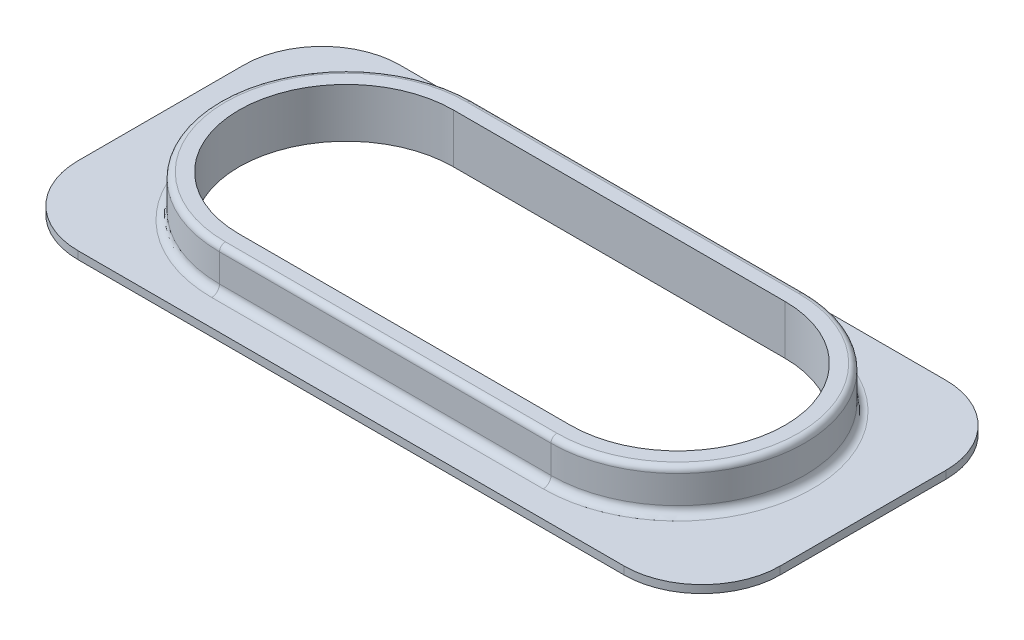
ISO-10303-21;
HEADER;
FILE_DESCRIPTION(('STEP AP214'),'2;1');
FILE_NAME('part.step','',(''),(''),'','','');
FILE_SCHEMA(('AUTOMOTIVE_DESIGN { 1 0 10303 214 1 1 1 1 }'));
ENDSEC;
DATA;
#1=APPLICATION_CONTEXT('core data for automotive mechanical design processes');
#2=APPLICATION_PROTOCOL_DEFINITION('international standard','automotive_design',2000,#1);
#3=PRODUCT_CONTEXT('',#1,'mechanical');
#4=PRODUCT('Part','Part','',(#3));
#5=PRODUCT_RELATED_PRODUCT_CATEGORY('part','',(#4));
#6=PRODUCT_DEFINITION_FORMATION('','',#4);
#7=PRODUCT_DEFINITION_CONTEXT('part definition',#1,'design');
#8=PRODUCT_DEFINITION('design','',#6,#7);
#9=PRODUCT_DEFINITION_SHAPE('','',#8);
#10=(LENGTH_UNIT() NAMED_UNIT(*) SI_UNIT(.MILLI.,.METRE.));
#11=(NAMED_UNIT(*) PLANE_ANGLE_UNIT() SI_UNIT($,.RADIAN.));
#12=(NAMED_UNIT(*) SI_UNIT($,.STERADIAN.) SOLID_ANGLE_UNIT());
#13=UNCERTAINTY_MEASURE_WITH_UNIT(LENGTH_MEASURE(1.E-05),#10,'distance_accuracy_value','');
#14=(GEOMETRIC_REPRESENTATION_CONTEXT(3) GLOBAL_UNCERTAINTY_ASSIGNED_CONTEXT((#13)) GLOBAL_UNIT_ASSIGNED_CONTEXT((#10,
#11,#12)) REPRESENTATION_CONTEXT('',''));
#15=CARTESIAN_POINT('',(0.,0.,0.));
#16=DIRECTION('',(0.,0.,1.));
#17=DIRECTION('',(1.,0.,0.));
#18=AXIS2_PLACEMENT_3D('',#15,#16,#17);
#19=CARTESIAN_POINT('',(-9.97047970479705,2.125,-1.47047970479705));
#20=DIRECTION('',(0.,1.,0.));
#21=DIRECTION('',(0.,0.,1.));
#22=AXIS2_PLACEMENT_3D('',#19,#20,#21);
#23=PLANE('',#22);
#24=DIRECTION('',(-1.,0.,0.));
#25=VECTOR('',#24,1.);
#26=CARTESIAN_POINT('',(-9.97047970479705,2.125,-7.67047970479705));
#27=LINE('',#26,#25);
#28=CARTESIAN_POINT('',(7.02952029520295,2.125,-7.67047970479705));
#29=VERTEX_POINT('',#28);
#30=CARTESIAN_POINT('',(-9.97047970479705,2.125,-7.67047970479705));
#31=VERTEX_POINT('',#30);
#32=EDGE_CURVE('E286',#29,#31,#27,.T.);
#33=ORIENTED_EDGE('',*,*,#32,.T.);
#34=CARTESIAN_POINT('',(-9.97047970479705,2.125,-1.47047970479705));
#35=DIRECTION('',(0.,1.,0.));
#36=DIRECTION('',(0.,0.,1.));
#37=AXIS2_PLACEMENT_3D('',#34,#35,#36);
#38=CIRCLE('',#37,6.2);
#39=CARTESIAN_POINT('',(-9.97047970479705,2.125,4.72952029520295));
#40=VERTEX_POINT('',#39);
#41=EDGE_CURVE('E288',#31,#40,#38,.T.);
#42=ORIENTED_EDGE('',*,*,#41,.T.);
#43=DIRECTION('',(1.,0.,0.));
#44=VECTOR('',#43,1.);
#45=CARTESIAN_POINT('',(7.02952029520295,2.125,4.72952029520295));
#46=LINE('',#45,#44);
#47=CARTESIAN_POINT('',(7.02952029520295,2.125,4.72952029520295));
#48=VERTEX_POINT('',#47);
#49=EDGE_CURVE('E282',#40,#48,#46,.T.);
#50=ORIENTED_EDGE('',*,*,#49,.T.);
#51=CARTESIAN_POINT('',(7.02952029520295,2.125,-1.47047970479705));
#52=DIRECTION('',(0.,1.,0.));
#53=DIRECTION('',(0.,0.,1.));
#54=AXIS2_PLACEMENT_3D('',#51,#52,#53);
#55=CIRCLE('',#54,6.2);
#56=EDGE_CURVE('E284',#48,#29,#55,.T.);
#57=ORIENTED_EDGE('',*,*,#56,.T.);
#58=EDGE_LOOP('',(#33,#42,#50,#57));
#59=FACE_BOUND('',#58,.T.);
#60=DIRECTION('',(1.,0.,0.));
#61=VECTOR('',#60,1.);
#62=CARTESIAN_POINT('',(-9.97047970479705,2.125,4.02952029520295));
#63=LINE('',#62,#61);
#64=CARTESIAN_POINT('',(-9.97047970479705,2.125,4.02952029520295));
#65=VERTEX_POINT('',#64);
#66=CARTESIAN_POINT('',(7.02952029520295,2.125,4.02952029520295));
#67=VERTEX_POINT('',#66);
#68=EDGE_CURVE('E225',#65,#67,#63,.T.);
#69=ORIENTED_EDGE('',*,*,#68,.F.);
#70=CARTESIAN_POINT('',(-9.97047970479705,2.125,-1.47047970479705));
#71=DIRECTION('',(0.,1.,0.));
#72=DIRECTION('',(0.,0.,1.));
#73=AXIS2_PLACEMENT_3D('',#70,#71,#72);
#74=CIRCLE('',#73,5.5);
#75=CARTESIAN_POINT('',(-9.97047970479705,2.125,-6.97047970479705));
#76=VERTEX_POINT('',#75);
#77=EDGE_CURVE('E210',#76,#65,#74,.T.);
#78=ORIENTED_EDGE('',*,*,#77,.F.);
#79=DIRECTION('',(-1.,0.,0.));
#80=VECTOR('',#79,1.);
#81=CARTESIAN_POINT('',(-9.97047970479705,2.125,-6.97047970479705));
#82=LINE('',#81,#80);
#83=CARTESIAN_POINT('',(7.02952029520295,2.125,-6.97047970479705));
#84=VERTEX_POINT('',#83);
#85=EDGE_CURVE('E182',#84,#76,#82,.T.);
#86=ORIENTED_EDGE('',*,*,#85,.F.);
#87=CARTESIAN_POINT('',(7.02952029520295,2.125,-1.47047970479705));
#88=DIRECTION('',(0.,1.,0.));
#89=DIRECTION('',(0.,0.,1.));
#90=AXIS2_PLACEMENT_3D('',#87,#88,#89);
#91=CIRCLE('',#90,5.5);
#92=EDGE_CURVE('E227',#67,#84,#91,.T.);
#93=ORIENTED_EDGE('',*,*,#92,.F.);
#94=EDGE_LOOP('',(#69,#78,#86,#93));
#95=FACE_BOUND('',#94,.T.);
#96=ADVANCED_FACE('F37',(#59,#95),#23,.T.);
#97=CARTESIAN_POINT('',(-9.97047970479705,2.125,-1.47047970479705));
#98=DIRECTION('',(0.,-1.,0.));
#99=DIRECTION('',(0.,0.,-1.));
#100=AXIS2_PLACEMENT_3D('',#97,#98,#99);
#101=CYLINDRICAL_SURFACE('',#100,6.5);
#102=DIRECTION('',(0.,-1.,0.));
#103=VECTOR('',#102,1.);
#104=CARTESIAN_POINT('',(-9.97047970479705,2.125,-7.97047970479705));
#105=LINE('',#104,#103);
#106=CARTESIAN_POINT('',(-9.97047970479705,1.825,-7.97047970479705));
#107=VERTEX_POINT('',#106);
#108=CARTESIAN_POINT('',(-9.97047970479705,0.4,-7.97047970479705));
#109=VERTEX_POINT('',#108);
#110=EDGE_CURVE('E235',#107,#109,#105,.T.);
#111=ORIENTED_EDGE('',*,*,#110,.T.);
#112=CARTESIAN_POINT('',(-9.97047970479705,0.4,-1.47047970479705));
#113=DIRECTION('',(0.,-1.,0.));
#114=DIRECTION('',(0.,0.,-1.));
#115=AXIS2_PLACEMENT_3D('',#112,#113,#114);
#116=CIRCLE('',#115,6.5);
#117=CARTESIAN_POINT('',(-9.97047970479705,0.4,5.02952029520295));
#118=VERTEX_POINT('',#117);
#119=EDGE_CURVE('E300',#109,#118,#116,.F.);
#120=ORIENTED_EDGE('',*,*,#119,.T.);
#121=DIRECTION('',(0.,-1.,0.));
#122=VECTOR('',#121,1.);
#123=CARTESIAN_POINT('',(-9.97047970479705,2.125,5.02952029520295));
#124=LINE('',#123,#122);
#125=CARTESIAN_POINT('',(-9.97047970479705,1.825,5.02952029520295));
#126=VERTEX_POINT('',#125);
#127=EDGE_CURVE('E242',#126,#118,#124,.T.);
#128=ORIENTED_EDGE('',*,*,#127,.F.);
#129=CARTESIAN_POINT('',(-9.97047970479705,1.825,-1.47047970479705));
#130=DIRECTION('',(0.,1.,0.));
#131=DIRECTION('',(0.,0.,1.));
#132=AXIS2_PLACEMENT_3D('',#129,#130,#131);
#133=CIRCLE('',#132,6.5);
#134=EDGE_CURVE('E291',#126,#107,#133,.F.);
#135=ORIENTED_EDGE('',*,*,#134,.T.);
#136=EDGE_LOOP('',(#111,#120,#128,#135));
#137=FACE_BOUND('',#136,.T.);
#138=ADVANCED_FACE('F352',(#137),#101,.T.);
#139=CARTESIAN_POINT('',(-9.97047970479705,2.125,5.02952029520295));
#140=DIRECTION('',(0.,0.,-1.));
#141=DIRECTION('',(-1.,0.,0.));
#142=AXIS2_PLACEMENT_3D('',#139,#140,#141);
#143=PLANE('',#142);
#144=ORIENTED_EDGE('',*,*,#127,.T.);
#145=DIRECTION('',(1.,0.,0.));
#146=VECTOR('',#145,1.);
#147=CARTESIAN_POINT('',(7.02952029520295,0.4,5.02952029520295));
#148=LINE('',#147,#146);
#149=CARTESIAN_POINT('',(7.02952029520295,0.4,5.02952029520295));
#150=VERTEX_POINT('',#149);
#151=EDGE_CURVE('E11',#118,#150,#148,.T.);
#152=ORIENTED_EDGE('',*,*,#151,.T.);
#153=DIRECTION('',(0.,-1.,0.));
#154=VECTOR('',#153,1.);
#155=CARTESIAN_POINT('',(7.02952029520295,2.125,5.02952029520295));
#156=LINE('',#155,#154);
#157=CARTESIAN_POINT('',(7.02952029520295,1.825,5.02952029520295));
#158=VERTEX_POINT('',#157);
#159=EDGE_CURVE('E240',#158,#150,#156,.T.);
#160=ORIENTED_EDGE('',*,*,#159,.F.);
#161=DIRECTION('',(1.,0.,0.));
#162=VECTOR('',#161,1.);
#163=CARTESIAN_POINT('',(-9.97047970479705,1.825,5.02952029520295));
#164=LINE('',#163,#162);
#165=EDGE_CURVE('E298',#158,#126,#164,.F.);
#166=ORIENTED_EDGE('',*,*,#165,.T.);
#167=EDGE_LOOP('',(#144,#152,#160,#166));
#168=FACE_BOUND('',#167,.T.);
#169=ADVANCED_FACE('F355',(#168),#143,.F.);
#170=CARTESIAN_POINT('',(7.02952029520295,2.125,-1.47047970479705));
#171=DIRECTION('',(0.,-1.,0.));
#172=DIRECTION('',(0.,0.,-1.));
#173=AXIS2_PLACEMENT_3D('',#170,#171,#172);
#174=CYLINDRICAL_SURFACE('',#173,6.5);
#175=ORIENTED_EDGE('',*,*,#159,.T.);
#176=CARTESIAN_POINT('',(7.02952029520295,0.4,-1.47047970479705));
#177=DIRECTION('',(0.,-1.,0.));
#178=DIRECTION('',(0.,0.,-1.));
#179=AXIS2_PLACEMENT_3D('',#176,#177,#178);
#180=CIRCLE('',#179,6.5);
#181=CARTESIAN_POINT('',(7.02952029520295,0.4,-7.97047970479705));
#182=VERTEX_POINT('',#181);
#183=EDGE_CURVE('E46',#150,#182,#180,.F.);
#184=ORIENTED_EDGE('',*,*,#183,.T.);
#185=DIRECTION('',(0.,-1.,0.));
#186=VECTOR('',#185,1.);
#187=CARTESIAN_POINT('',(7.02952029520295,2.125,-7.97047970479705));
#188=LINE('',#187,#186);
#189=CARTESIAN_POINT('',(7.02952029520295,1.825,-7.97047970479705));
#190=VERTEX_POINT('',#189);
#191=EDGE_CURVE('E238',#190,#182,#188,.T.);
#192=ORIENTED_EDGE('',*,*,#191,.F.);
#193=CARTESIAN_POINT('',(7.02952029520295,1.825,-1.47047970479705));
#194=DIRECTION('',(0.,1.,0.));
#195=DIRECTION('',(0.,0.,1.));
#196=AXIS2_PLACEMENT_3D('',#193,#194,#195);
#197=CIRCLE('',#196,6.5);
#198=EDGE_CURVE('E296',#190,#158,#197,.F.);
#199=ORIENTED_EDGE('',*,*,#198,.T.);
#200=EDGE_LOOP('',(#175,#184,#192,#199));
#201=FACE_BOUND('',#200,.T.);
#202=ADVANCED_FACE('F370',(#201),#174,.T.);
#203=CARTESIAN_POINT('',(-9.97047970479705,2.125,-7.97047970479705));
#204=DIRECTION('',(0.,0.,1.));
#205=DIRECTION('',(1.,0.,0.));
#206=AXIS2_PLACEMENT_3D('',#203,#204,#205);
#207=PLANE('',#206);
#208=ORIENTED_EDGE('',*,*,#191,.T.);
#209=DIRECTION('',(-1.,0.,0.));
#210=VECTOR('',#209,1.);
#211=CARTESIAN_POINT('',(-9.97047970479705,0.4,-7.97047970479705));
#212=LINE('',#211,#210);
#213=EDGE_CURVE('E321',#182,#109,#212,.T.);
#214=ORIENTED_EDGE('',*,*,#213,.T.);
#215=ORIENTED_EDGE('',*,*,#110,.F.);
#216=DIRECTION('',(-1.,0.,0.));
#217=VECTOR('',#216,1.);
#218=CARTESIAN_POINT('',(7.02952029520295,1.825,-7.97047970479705));
#219=LINE('',#218,#217);
#220=EDGE_CURVE('E294',#107,#190,#219,.F.);
#221=ORIENTED_EDGE('',*,*,#220,.T.);
#222=EDGE_LOOP('',(#208,#214,#215,#221));
#223=FACE_BOUND('',#222,.T.);
#224=ADVANCED_FACE('F368',(#223),#207,.F.);
#225=CARTESIAN_POINT('',(-9.97047970479705,2.125,-1.47047970479705));
#226=DIRECTION('',(0.,-1.,0.));
#227=DIRECTION('',(0.,0.,-1.));
#228=AXIS2_PLACEMENT_3D('',#225,#226,#227);
#229=CYLINDRICAL_SURFACE('',#228,5.5);
#230=DIRECTION('',(0.,-1.,0.));
#231=VECTOR('',#230,1.);
#232=CARTESIAN_POINT('',(-9.97047970479705,2.125,4.02952029520295));
#233=LINE('',#232,#231);
#234=CARTESIAN_POINT('',(-9.97047970479705,-0.4,4.02952029520295));
#235=VERTEX_POINT('',#234);
#236=EDGE_CURVE('E191',#65,#235,#233,.T.);
#237=ORIENTED_EDGE('',*,*,#236,.T.);
#238=CARTESIAN_POINT('',(-9.97047970479705,-0.4,-1.47047970479705));
#239=DIRECTION('',(0.,-1.,0.));
#240=DIRECTION('',(0.,0.,-1.));
#241=AXIS2_PLACEMENT_3D('',#238,#239,#240);
#242=CIRCLE('',#241,5.5);
#243=CARTESIAN_POINT('',(-9.97047970479705,-0.4,-6.97047970479705));
#244=VERTEX_POINT('',#243);
#245=EDGE_CURVE('E188',#244,#235,#242,.F.);
#246=ORIENTED_EDGE('',*,*,#245,.F.);
#247=DIRECTION('',(0.,-1.,0.));
#248=VECTOR('',#247,1.);
#249=CARTESIAN_POINT('',(-9.97047970479705,2.125,-6.97047970479705));
#250=LINE('',#249,#248);
#251=EDGE_CURVE('E176',#76,#244,#250,.T.);
#252=ORIENTED_EDGE('',*,*,#251,.F.);
#253=ORIENTED_EDGE('',*,*,#77,.T.);
#254=EDGE_LOOP('',(#237,#246,#252,#253));
#255=FACE_BOUND('',#254,.T.);
#256=ADVANCED_FACE('F189',(#255),#229,.F.);
#257=CARTESIAN_POINT('',(-9.97047970479705,2.125,4.02952029520295));
#258=DIRECTION('',(0.,0.,-1.));
#259=DIRECTION('',(-1.,0.,0.));
#260=AXIS2_PLACEMENT_3D('',#257,#258,#259);
#261=PLANE('',#260);
#262=DIRECTION('',(0.,-1.,0.));
#263=VECTOR('',#262,1.);
#264=CARTESIAN_POINT('',(7.02952029520295,2.125,4.02952029520295));
#265=LINE('',#264,#263);
#266=CARTESIAN_POINT('',(7.02952029520295,-0.4,4.02952029520295));
#267=VERTEX_POINT('',#266);
#268=EDGE_CURVE('E232',#67,#267,#265,.T.);
#269=ORIENTED_EDGE('',*,*,#268,.T.);
#270=DIRECTION('',(1.,0.,0.));
#271=VECTOR('',#270,1.);
#272=CARTESIAN_POINT('',(0.,-0.4,4.02952029520295));
#273=LINE('',#272,#271);
#274=EDGE_CURVE('E195',#235,#267,#273,.T.);
#275=ORIENTED_EDGE('',*,*,#274,.F.);
#276=ORIENTED_EDGE('',*,*,#236,.F.);
#277=ORIENTED_EDGE('',*,*,#68,.T.);
#278=EDGE_LOOP('',(#269,#275,#276,#277));
#279=FACE_BOUND('',#278,.T.);
#280=ADVANCED_FACE('F386',(#279),#261,.T.);
#281=CARTESIAN_POINT('',(7.02952029520295,2.125,-1.47047970479705));
#282=DIRECTION('',(0.,-1.,0.));
#283=DIRECTION('',(0.,0.,-1.));
#284=AXIS2_PLACEMENT_3D('',#281,#282,#283);
#285=CYLINDRICAL_SURFACE('',#284,5.5);
#286=DIRECTION('',(0.,-1.,0.));
#287=VECTOR('',#286,1.);
#288=CARTESIAN_POINT('',(7.02952029520295,2.125,-6.97047970479705));
#289=LINE('',#288,#287);
#290=CARTESIAN_POINT('',(7.02952029520295,-0.4,-6.97047970479705));
#291=VERTEX_POINT('',#290);
#292=EDGE_CURVE('E185',#84,#291,#289,.T.);
#293=ORIENTED_EDGE('',*,*,#292,.T.);
#294=CARTESIAN_POINT('',(7.02952029520295,-0.4,-1.47047970479705));
#295=DIRECTION('',(0.,-1.,0.));
#296=DIRECTION('',(0.,0.,-1.));
#297=AXIS2_PLACEMENT_3D('',#294,#295,#296);
#298=CIRCLE('',#297,5.5);
#299=EDGE_CURVE('E200',#267,#291,#298,.F.);
#300=ORIENTED_EDGE('',*,*,#299,.F.);
#301=ORIENTED_EDGE('',*,*,#268,.F.);
#302=ORIENTED_EDGE('',*,*,#92,.T.);
#303=EDGE_LOOP('',(#293,#300,#301,#302));
#304=FACE_BOUND('',#303,.T.);
#305=ADVANCED_FACE('F388',(#304),#285,.F.);
#306=CARTESIAN_POINT('',(-9.97047970479705,2.125,-6.97047970479705));
#307=DIRECTION('',(0.,0.,1.));
#308=DIRECTION('',(1.,0.,0.));
#309=AXIS2_PLACEMENT_3D('',#306,#307,#308);
#310=PLANE('',#309);
#311=ORIENTED_EDGE('',*,*,#251,.T.);
#312=DIRECTION('',(-1.,0.,0.));
#313=VECTOR('',#312,1.);
#314=CARTESIAN_POINT('',(0.,-0.4,-6.97047970479705));
#315=LINE('',#314,#313);
#316=EDGE_CURVE('E180',#291,#244,#315,.T.);
#317=ORIENTED_EDGE('',*,*,#316,.F.);
#318=ORIENTED_EDGE('',*,*,#292,.F.);
#319=ORIENTED_EDGE('',*,*,#85,.T.);
#320=EDGE_LOOP('',(#311,#317,#318,#319));
#321=FACE_BOUND('',#320,.T.);
#322=ADVANCED_FACE('F178',(#321),#310,.T.);
#323=CARTESIAN_POINT('',(0.,-0.4,6.77952029520295));
#324=DIRECTION('',(0.,0.,-1.));
#325=DIRECTION('',(-1.,0.,0.));
#326=AXIS2_PLACEMENT_3D('',#323,#324,#325);
#327=PLANE('',#326);
#328=DIRECTION('',(-1.,0.,0.));
#329=VECTOR('',#328,1.);
#330=CARTESIAN_POINT('',(0.,-0.4,6.77952029520295));
#331=LINE('',#330,#329);
#332=CARTESIAN_POINT('',(12.5295202952029,-0.4,6.77952029520295));
#333=VERTEX_POINT('',#332);
#334=CARTESIAN_POINT('',(-15.4704797047971,-0.4,6.77952029520295));
#335=VERTEX_POINT('',#334);
#336=EDGE_CURVE('E223',#333,#335,#331,.T.);
#337=ORIENTED_EDGE('',*,*,#336,.F.);
#338=DIRECTION('',(0.,1.,0.));
#339=VECTOR('',#338,1.);
#340=CARTESIAN_POINT('',(12.5295202952029,0.,6.77952029520295));
#341=LINE('',#340,#339);
#342=CARTESIAN_POINT('',(12.5295202952029,0.,6.77952029520295));
#343=VERTEX_POINT('',#342);
#344=EDGE_CURVE('E255',#333,#343,#341,.T.);
#345=ORIENTED_EDGE('',*,*,#344,.T.);
#346=DIRECTION('',(-1.,0.,0.));
#347=VECTOR('',#346,1.);
#348=CARTESIAN_POINT('',(0.,0.,6.77952029520295));
#349=LINE('',#348,#347);
#350=CARTESIAN_POINT('',(-15.4704797047971,0.,6.77952029520295));
#351=VERTEX_POINT('',#350);
#352=EDGE_CURVE('E211',#343,#351,#349,.T.);
#353=ORIENTED_EDGE('',*,*,#352,.T.);
#354=DIRECTION('',(0.,1.,0.));
#355=VECTOR('',#354,1.);
#356=CARTESIAN_POINT('',(-15.4704797047971,-0.4,6.77952029520295));
#357=LINE('',#356,#355);
#358=EDGE_CURVE('E250',#351,#335,#357,.F.);
#359=ORIENTED_EDGE('',*,*,#358,.T.);
#360=EDGE_LOOP('',(#337,#345,#353,#359));
#361=FACE_BOUND('',#360,.T.);
#362=ADVANCED_FACE('F395',(#361),#327,.F.);
#363=CARTESIAN_POINT('',(-19.4704797047971,-0.4,0.));
#364=DIRECTION('',(1.,0.,0.));
#365=DIRECTION('',(0.,0.,-1.));
#366=AXIS2_PLACEMENT_3D('',#363,#364,#365);
#367=PLANE('',#366);
#368=DIRECTION('',(0.,0.,-1.));
#369=VECTOR('',#368,1.);
#370=CARTESIAN_POINT('',(-19.4704797047971,0.,0.));
#371=LINE('',#370,#369);
#372=CARTESIAN_POINT('',(-19.4704797047971,0.,2.77952029520295));
#373=VERTEX_POINT('',#372);
#374=CARTESIAN_POINT('',(-19.4704797047971,0.,-5.72047970479705));
#375=VERTEX_POINT('',#374);
#376=EDGE_CURVE('E213',#373,#375,#371,.T.);
#377=ORIENTED_EDGE('',*,*,#376,.T.);
#378=DIRECTION('',(0.,1.,0.));
#379=VECTOR('',#378,1.);
#380=CARTESIAN_POINT('',(-19.4704797047971,-0.4,-5.72047970479705));
#381=LINE('',#380,#379);
#382=CARTESIAN_POINT('',(-19.4704797047971,-0.4,-5.72047970479705));
#383=VERTEX_POINT('',#382);
#384=EDGE_CURVE('E280',#375,#383,#381,.F.);
#385=ORIENTED_EDGE('',*,*,#384,.T.);
#386=DIRECTION('',(0.,0.,-1.));
#387=VECTOR('',#386,1.);
#388=CARTESIAN_POINT('',(-19.4704797047971,-0.4,0.));
#389=LINE('',#388,#387);
#390=CARTESIAN_POINT('',(-19.4704797047971,-0.4,2.77952029520295));
#391=VERTEX_POINT('',#390);
#392=EDGE_CURVE('E641',#391,#383,#389,.T.);
#393=ORIENTED_EDGE('',*,*,#392,.F.);
#394=DIRECTION('',(0.,1.,0.));
#395=VECTOR('',#394,1.);
#396=CARTESIAN_POINT('',(-19.4704797047971,-0.4,2.77952029520295));
#397=LINE('',#396,#395);
#398=EDGE_CURVE('E244',#391,#373,#397,.T.);
#399=ORIENTED_EDGE('',*,*,#398,.T.);
#400=EDGE_LOOP('',(#377,#385,#393,#399));
#401=FACE_BOUND('',#400,.T.);
#402=ADVANCED_FACE('F508',(#401),#367,.F.);
#403=CARTESIAN_POINT('',(0.,-0.4,-9.72047970479705));
#404=DIRECTION('',(0.,0.,-1.));
#405=DIRECTION('',(-1.,0.,0.));
#406=AXIS2_PLACEMENT_3D('',#403,#404,#405);
#407=PLANE('',#406);
#408=DIRECTION('',(-1.,0.,0.));
#409=VECTOR('',#408,1.);
#410=CARTESIAN_POINT('',(0.,0.,-9.72047970479705));
#411=LINE('',#410,#409);
#412=CARTESIAN_POINT('',(12.5295202952029,0.,-9.72047970479705));
#413=VERTEX_POINT('',#412);
#414=CARTESIAN_POINT('',(-15.4704797047971,0.,-9.72047970479705));
#415=VERTEX_POINT('',#414);
#416=EDGE_CURVE('E217',#413,#415,#411,.T.);
#417=ORIENTED_EDGE('',*,*,#416,.F.);
#418=DIRECTION('',(0.,1.,0.));
#419=VECTOR('',#418,1.);
#420=CARTESIAN_POINT('',(12.5295202952029,-0.4,-9.72047970479705));
#421=LINE('',#420,#419);
#422=CARTESIAN_POINT('',(12.5295202952029,-0.4,-9.72047970479705));
#423=VERTEX_POINT('',#422);
#424=EDGE_CURVE('E278',#413,#423,#421,.F.);
#425=ORIENTED_EDGE('',*,*,#424,.T.);
#426=DIRECTION('',(-1.,0.,0.));
#427=VECTOR('',#426,1.);
#428=CARTESIAN_POINT('',(0.,-0.4,-9.72047970479705));
#429=LINE('',#428,#427);
#430=CARTESIAN_POINT('',(-15.4704797047971,-0.4,-9.72047970479705));
#431=VERTEX_POINT('',#430);
#432=EDGE_CURVE('E204',#423,#431,#429,.T.);
#433=ORIENTED_EDGE('',*,*,#432,.T.);
#434=DIRECTION('',(0.,1.,0.));
#435=VECTOR('',#434,1.);
#436=CARTESIAN_POINT('',(-15.4704797047971,0.,-9.72047970479705));
#437=LINE('',#436,#435);
#438=EDGE_CURVE('E275',#431,#415,#437,.T.);
#439=ORIENTED_EDGE('',*,*,#438,.T.);
#440=EDGE_LOOP('',(#417,#425,#433,#439));
#441=FACE_BOUND('',#440,.T.);
#442=ADVANCED_FACE('F500',(#441),#407,.T.);
#443=CARTESIAN_POINT('',(16.5295202952029,-0.4,0.));
#444=DIRECTION('',(1.,0.,0.));
#445=DIRECTION('',(0.,0.,-1.));
#446=AXIS2_PLACEMENT_3D('',#443,#444,#445);
#447=PLANE('',#446);
#448=DIRECTION('',(0.,0.,-1.));
#449=VECTOR('',#448,1.);
#450=CARTESIAN_POINT('',(16.5295202952029,0.,0.));
#451=LINE('',#450,#449);
#452=CARTESIAN_POINT('',(16.5295202952029,0.,2.77952029520295));
#453=VERTEX_POINT('',#452);
#454=CARTESIAN_POINT('',(16.5295202952029,0.,-5.72047970479705));
#455=VERTEX_POINT('',#454);
#456=EDGE_CURVE('E220',#453,#455,#451,.T.);
#457=ORIENTED_EDGE('',*,*,#456,.F.);
#458=DIRECTION('',(0.,1.,0.));
#459=VECTOR('',#458,1.);
#460=CARTESIAN_POINT('',(16.5295202952029,-0.4,2.77952029520295));
#461=LINE('',#460,#459);
#462=CARTESIAN_POINT('',(16.5295202952029,-0.4,2.77952029520295));
#463=VERTEX_POINT('',#462);
#464=EDGE_CURVE('E267',#453,#463,#461,.F.);
#465=ORIENTED_EDGE('',*,*,#464,.T.);
#466=DIRECTION('',(0.,0.,-1.));
#467=VECTOR('',#466,1.);
#468=CARTESIAN_POINT('',(16.5295202952029,-0.4,0.));
#469=LINE('',#468,#467);
#470=CARTESIAN_POINT('',(16.5295202952029,-0.4,-5.72047970479705));
#471=VERTEX_POINT('',#470);
#472=EDGE_CURVE('E201',#463,#471,#469,.T.);
#473=ORIENTED_EDGE('',*,*,#472,.T.);
#474=DIRECTION('',(0.,1.,0.));
#475=VECTOR('',#474,1.);
#476=CARTESIAN_POINT('',(16.5295202952029,-0.4,-5.72047970479705));
#477=LINE('',#476,#475);
#478=EDGE_CURVE('E264',#471,#455,#477,.T.);
#479=ORIENTED_EDGE('',*,*,#478,.T.);
#480=EDGE_LOOP('',(#457,#465,#473,#479));
#481=FACE_BOUND('',#480,.T.);
#482=ADVANCED_FACE('F492',(#481),#447,.T.);
#483=CARTESIAN_POINT('',(0.,-0.4,0.));
#484=DIRECTION('',(0.,-1.,0.));
#485=DIRECTION('',(0.,0.,-1.));
#486=AXIS2_PLACEMENT_3D('',#483,#484,#485);
#487=PLANE('',#486);
#488=ORIENTED_EDGE('',*,*,#472,.F.);
#489=CARTESIAN_POINT('',(12.5295202952029,-0.4,2.77952029520295));
#490=DIRECTION('',(0.,-1.,0.));
#491=DIRECTION('',(0.,0.,-1.));
#492=AXIS2_PLACEMENT_3D('',#489,#490,#491);
#493=CIRCLE('',#492,4.);
#494=EDGE_CURVE('E273',#463,#333,#493,.T.);
#495=ORIENTED_EDGE('',*,*,#494,.T.);
#496=ORIENTED_EDGE('',*,*,#336,.T.);
#497=CARTESIAN_POINT('',(-15.4704797047971,-0.4,2.77952029520295));
#498=DIRECTION('',(0.,-1.,0.));
#499=DIRECTION('',(0.,0.,-1.));
#500=AXIS2_PLACEMENT_3D('',#497,#498,#499);
#501=CIRCLE('',#500,4.);
#502=EDGE_CURVE('E253',#335,#391,#501,.T.);
#503=ORIENTED_EDGE('',*,*,#502,.T.);
#504=ORIENTED_EDGE('',*,*,#392,.T.);
#505=CARTESIAN_POINT('',(-15.4704797047971,-0.4,-5.72047970479705));
#506=DIRECTION('',(0.,-1.,0.));
#507=DIRECTION('',(0.,0.,-1.));
#508=AXIS2_PLACEMENT_3D('',#505,#506,#507);
#509=CIRCLE('',#508,4.);
#510=EDGE_CURVE('E269',#383,#431,#509,.T.);
#511=ORIENTED_EDGE('',*,*,#510,.T.);
#512=ORIENTED_EDGE('',*,*,#432,.F.);
#513=CARTESIAN_POINT('',(12.5295202952029,-0.4,-5.72047970479705));
#514=DIRECTION('',(0.,-1.,0.));
#515=DIRECTION('',(0.,0.,-1.));
#516=AXIS2_PLACEMENT_3D('',#513,#514,#515);
#517=CIRCLE('',#516,4.);
#518=EDGE_CURVE('E271',#423,#471,#517,.T.);
#519=ORIENTED_EDGE('',*,*,#518,.T.);
#520=EDGE_LOOP('',(#488,#495,#496,#503,#504,#511,#512,#519));
#521=FACE_BOUND('',#520,.T.);
#522=ORIENTED_EDGE('',*,*,#316,.T.);
#523=ORIENTED_EDGE('',*,*,#245,.T.);
#524=ORIENTED_EDGE('',*,*,#274,.T.);
#525=ORIENTED_EDGE('',*,*,#299,.T.);
#526=EDGE_LOOP('',(#522,#523,#524,#525));
#527=FACE_BOUND('',#526,.T.);
#528=ADVANCED_FACE('F198',(#521,#527),#487,.T.);
#529=CARTESIAN_POINT('',(0.,0.,0.));
#530=DIRECTION('',(0.,-1.,0.));
#531=DIRECTION('',(0.,0.,-1.));
#532=AXIS2_PLACEMENT_3D('',#529,#530,#531);
#533=PLANE('',#532);
#534=DIRECTION('',(1.,0.,0.));
#535=VECTOR('',#534,1.);
#536=CARTESIAN_POINT('',(-9.97047970479705,0.,5.42952029520295));
#537=LINE('',#536,#535);
#538=CARTESIAN_POINT('',(7.02952029520295,0.,5.42952029520295));
#539=VERTEX_POINT('',#538);
#540=CARTESIAN_POINT('',(-9.97047970479705,0.,5.42952029520295));
#541=VERTEX_POINT('',#540);
#542=EDGE_CURVE('E312',#539,#541,#537,.F.);
#543=ORIENTED_EDGE('',*,*,#542,.T.);
#544=CARTESIAN_POINT('',(-9.97047970479705,0.,-1.47047970479705));
#545=DIRECTION('',(0.,-1.,0.));
#546=DIRECTION('',(0.,0.,-1.));
#547=AXIS2_PLACEMENT_3D('',#544,#545,#546);
#548=CIRCLE('',#547,6.9);
#549=CARTESIAN_POINT('',(-9.97047970479705,0.,-8.37047970479705));
#550=VERTEX_POINT('',#549);
#551=EDGE_CURVE('E318',#541,#550,#548,.T.);
#552=ORIENTED_EDGE('',*,*,#551,.T.);
#553=DIRECTION('',(-1.,0.,0.));
#554=VECTOR('',#553,1.);
#555=CARTESIAN_POINT('',(7.02952029520295,0.,-8.37047970479705));
#556=LINE('',#555,#554);
#557=CARTESIAN_POINT('',(7.02952029520295,0.,-8.37047970479705));
#558=VERTEX_POINT('',#557);
#559=EDGE_CURVE('E316',#550,#558,#556,.F.);
#560=ORIENTED_EDGE('',*,*,#559,.T.);
#561=CARTESIAN_POINT('',(7.02952029520295,0.,-1.47047970479705));
#562=DIRECTION('',(0.,-1.,0.));
#563=DIRECTION('',(0.,0.,-1.));
#564=AXIS2_PLACEMENT_3D('',#561,#562,#563);
#565=CIRCLE('',#564,6.9);
#566=EDGE_CURVE('E314',#558,#539,#565,.T.);
#567=ORIENTED_EDGE('',*,*,#566,.T.);
#568=EDGE_LOOP('',(#543,#552,#560,#567));
#569=FACE_BOUND('',#568,.T.);
#570=ORIENTED_EDGE('',*,*,#352,.F.);
#571=CARTESIAN_POINT('',(12.5295202952029,0.,2.77952029520295));
#572=DIRECTION('',(0.,-1.,0.));
#573=DIRECTION('',(0.,0.,-1.));
#574=AXIS2_PLACEMENT_3D('',#571,#572,#573);
#575=CIRCLE('',#574,4.);
#576=EDGE_CURVE('E262',#343,#453,#575,.F.);
#577=ORIENTED_EDGE('',*,*,#576,.T.);
#578=ORIENTED_EDGE('',*,*,#456,.T.);
#579=CARTESIAN_POINT('',(12.5295202952029,0.,-5.72047970479705));
#580=DIRECTION('',(0.,-1.,0.));
#581=DIRECTION('',(0.,0.,-1.));
#582=AXIS2_PLACEMENT_3D('',#579,#580,#581);
#583=CIRCLE('',#582,4.);
#584=EDGE_CURVE('E260',#455,#413,#583,.F.);
#585=ORIENTED_EDGE('',*,*,#584,.T.);
#586=ORIENTED_EDGE('',*,*,#416,.T.);
#587=CARTESIAN_POINT('',(-15.4704797047971,0.,-5.72047970479705));
#588=DIRECTION('',(0.,-1.,0.));
#589=DIRECTION('',(0.,0.,-1.));
#590=AXIS2_PLACEMENT_3D('',#587,#588,#589);
#591=CIRCLE('',#590,4.);
#592=EDGE_CURVE('E258',#415,#375,#591,.F.);
#593=ORIENTED_EDGE('',*,*,#592,.T.);
#594=ORIENTED_EDGE('',*,*,#376,.F.);
#595=CARTESIAN_POINT('',(-15.4704797047971,0.,2.77952029520295));
#596=DIRECTION('',(0.,-1.,0.));
#597=DIRECTION('',(0.,0.,-1.));
#598=AXIS2_PLACEMENT_3D('',#595,#596,#597);
#599=CIRCLE('',#598,4.);
#600=EDGE_CURVE('E247',#373,#351,#599,.F.);
#601=ORIENTED_EDGE('',*,*,#600,.T.);
#602=EDGE_LOOP('',(#570,#577,#578,#585,#586,#593,#594,#601));
#603=FACE_BOUND('',#602,.T.);
#604=ADVANCED_FACE('F342',(#569,#603),#533,.F.);
#605=CARTESIAN_POINT('',(-15.4704797047971,-0.4,2.77952029520295));
#606=DIRECTION('',(0.,1.,0.));
#607=DIRECTION('',(0.,0.,1.));
#608=AXIS2_PLACEMENT_3D('',#605,#606,#607);
#609=CYLINDRICAL_SURFACE('',#608,4.);
#610=ORIENTED_EDGE('',*,*,#502,.F.);
#611=ORIENTED_EDGE('',*,*,#358,.F.);
#612=ORIENTED_EDGE('',*,*,#600,.F.);
#613=ORIENTED_EDGE('',*,*,#398,.F.);
#614=EDGE_LOOP('',(#610,#611,#612,#613));
#615=FACE_BOUND('',#614,.T.);
#616=ADVANCED_FACE('F410',(#615),#609,.T.);
#617=CARTESIAN_POINT('',(12.5295202952029,-0.4,2.77952029520295));
#618=DIRECTION('',(0.,-1.,0.));
#619=DIRECTION('',(0.,0.,-1.));
#620=AXIS2_PLACEMENT_3D('',#617,#618,#619);
#621=CYLINDRICAL_SURFACE('',#620,4.);
#622=ORIENTED_EDGE('',*,*,#494,.F.);
#623=ORIENTED_EDGE('',*,*,#464,.F.);
#624=ORIENTED_EDGE('',*,*,#576,.F.);
#625=ORIENTED_EDGE('',*,*,#344,.F.);
#626=EDGE_LOOP('',(#622,#623,#624,#625));
#627=FACE_BOUND('',#626,.T.);
#628=ADVANCED_FACE('F413',(#627),#621,.T.);
#629=CARTESIAN_POINT('',(12.5295202952029,-0.4,-5.72047970479705));
#630=DIRECTION('',(0.,1.,0.));
#631=DIRECTION('',(0.,0.,1.));
#632=AXIS2_PLACEMENT_3D('',#629,#630,#631);
#633=CYLINDRICAL_SURFACE('',#632,4.);
#634=ORIENTED_EDGE('',*,*,#518,.F.);
#635=ORIENTED_EDGE('',*,*,#424,.F.);
#636=ORIENTED_EDGE('',*,*,#584,.F.);
#637=ORIENTED_EDGE('',*,*,#478,.F.);
#638=EDGE_LOOP('',(#634,#635,#636,#637));
#639=FACE_BOUND('',#638,.T.);
#640=ADVANCED_FACE('F417',(#639),#633,.T.);
#641=CARTESIAN_POINT('',(-15.4704797047971,-0.4,-5.72047970479705));
#642=DIRECTION('',(0.,-1.,0.));
#643=DIRECTION('',(0.,0.,-1.));
#644=AXIS2_PLACEMENT_3D('',#641,#642,#643);
#645=CYLINDRICAL_SURFACE('',#644,4.);
#646=ORIENTED_EDGE('',*,*,#510,.F.);
#647=ORIENTED_EDGE('',*,*,#384,.F.);
#648=ORIENTED_EDGE('',*,*,#592,.F.);
#649=ORIENTED_EDGE('',*,*,#438,.F.);
#650=EDGE_LOOP('',(#646,#647,#648,#649));
#651=FACE_BOUND('',#650,.T.);
#652=ADVANCED_FACE('F421',(#651),#645,.T.);
#653=CARTESIAN_POINT('',(7.02952029520295,1.825,-1.47047970479705));
#654=DIRECTION('',(0.,1.,0.));
#655=DIRECTION('',(0.,0.,1.));
#656=AXIS2_PLACEMENT_3D('',#653,#654,#655);
#657=TOROIDAL_SURFACE('',#656,6.2,0.3);
#658=CARTESIAN_POINT('',(7.02952029520295,1.825,4.72952029520295));
#659=DIRECTION('',(-1.,0.,0.));
#660=DIRECTION('',(0.,0.,1.));
#661=AXIS2_PLACEMENT_3D('',#658,#659,#660);
#662=CIRCLE('',#661,0.3);
#663=EDGE_CURVE('E305',#158,#48,#662,.T.);
#664=ORIENTED_EDGE('',*,*,#663,.F.);
#665=ORIENTED_EDGE('',*,*,#198,.F.);
#666=CARTESIAN_POINT('',(7.02952029520295,1.825,-7.67047970479705));
#667=DIRECTION('',(-1.,0.,0.));
#668=DIRECTION('',(0.,0.,1.));
#669=AXIS2_PLACEMENT_3D('',#666,#667,#668);
#670=CIRCLE('',#669,0.3);
#671=EDGE_CURVE('E214',#29,#190,#670,.T.);
#672=ORIENTED_EDGE('',*,*,#671,.F.);
#673=ORIENTED_EDGE('',*,*,#56,.F.);
#674=EDGE_LOOP('',(#664,#665,#672,#673));
#675=FACE_BOUND('',#674,.T.);
#676=ADVANCED_FACE('F373',(#675),#657,.T.);
#677=CARTESIAN_POINT('',(-9.97047970479705,1.825,-7.67047970479705));
#678=DIRECTION('',(1.,0.,0.));
#679=DIRECTION('',(0.,0.,-1.));
#680=AXIS2_PLACEMENT_3D('',#677,#678,#679);
#681=CYLINDRICAL_SURFACE('',#680,0.3);
#682=ORIENTED_EDGE('',*,*,#671,.T.);
#683=ORIENTED_EDGE('',*,*,#220,.F.);
#684=CARTESIAN_POINT('',(-9.97047970479705,1.825,-7.67047970479705));
#685=DIRECTION('',(-1.,0.,0.));
#686=DIRECTION('',(0.,0.,1.));
#687=AXIS2_PLACEMENT_3D('',#684,#685,#686);
#688=CIRCLE('',#687,0.3);
#689=EDGE_CURVE('E303',#31,#107,#688,.T.);
#690=ORIENTED_EDGE('',*,*,#689,.F.);
#691=ORIENTED_EDGE('',*,*,#32,.F.);
#692=EDGE_LOOP('',(#682,#683,#690,#691));
#693=FACE_BOUND('',#692,.T.);
#694=ADVANCED_FACE('F377',(#693),#681,.T.);
#695=CARTESIAN_POINT('',(-9.97047970479705,1.825,4.72952029520295));
#696=DIRECTION('',(-1.,0.,0.));
#697=DIRECTION('',(0.,0.,1.));
#698=AXIS2_PLACEMENT_3D('',#695,#696,#697);
#699=CYLINDRICAL_SURFACE('',#698,0.3);
#700=ORIENTED_EDGE('',*,*,#663,.T.);
#701=ORIENTED_EDGE('',*,*,#49,.F.);
#702=CARTESIAN_POINT('',(-9.97047970479705,1.825,4.72952029520295));
#703=DIRECTION('',(-1.,0.,0.));
#704=DIRECTION('',(0.,0.,1.));
#705=AXIS2_PLACEMENT_3D('',#702,#703,#704);
#706=CIRCLE('',#705,0.3);
#707=EDGE_CURVE('E301',#126,#40,#706,.T.);
#708=ORIENTED_EDGE('',*,*,#707,.F.);
#709=ORIENTED_EDGE('',*,*,#165,.F.);
#710=EDGE_LOOP('',(#700,#701,#708,#709));
#711=FACE_BOUND('',#710,.T.);
#712=ADVANCED_FACE('F360',(#711),#699,.T.);
#713=CARTESIAN_POINT('',(-9.97047970479705,1.825,-1.47047970479705));
#714=DIRECTION('',(0.,1.,0.));
#715=DIRECTION('',(0.,0.,1.));
#716=AXIS2_PLACEMENT_3D('',#713,#714,#715);
#717=TOROIDAL_SURFACE('',#716,6.2,0.3);
#718=ORIENTED_EDGE('',*,*,#689,.T.);
#719=ORIENTED_EDGE('',*,*,#134,.F.);
#720=ORIENTED_EDGE('',*,*,#707,.T.);
#721=ORIENTED_EDGE('',*,*,#41,.F.);
#722=EDGE_LOOP('',(#718,#719,#720,#721));
#723=FACE_BOUND('',#722,.T.);
#724=ADVANCED_FACE('F364',(#723),#717,.T.);
#725=CARTESIAN_POINT('',(7.02952029520295,0.4,-1.47047970479705));
#726=DIRECTION('',(0.,-1.,0.));
#727=DIRECTION('',(0.,0.,-1.));
#728=AXIS2_PLACEMENT_3D('',#725,#726,#727);
#729=TOROIDAL_SURFACE('',#728,6.9,0.4);
#730=CARTESIAN_POINT('',(7.02952029520295,0.4,5.42952029520295));
#731=DIRECTION('',(1.,0.,0.));
#732=DIRECTION('',(0.,0.,-1.));
#733=AXIS2_PLACEMENT_3D('',#730,#731,#732);
#734=CIRCLE('',#733,0.4);
#735=EDGE_CURVE('E327',#539,#150,#734,.T.);
#736=ORIENTED_EDGE('',*,*,#735,.F.);
#737=ORIENTED_EDGE('',*,*,#566,.F.);
#738=CARTESIAN_POINT('',(7.02952029520295,0.4,-8.37047970479705));
#739=DIRECTION('',(1.,0.,0.));
#740=DIRECTION('',(0.,0.,-1.));
#741=AXIS2_PLACEMENT_3D('',#738,#739,#740);
#742=CIRCLE('',#741,0.4);
#743=EDGE_CURVE('E41',#182,#558,#742,.T.);
#744=ORIENTED_EDGE('',*,*,#743,.F.);
#745=ORIENTED_EDGE('',*,*,#183,.F.);
#746=EDGE_LOOP('',(#736,#737,#744,#745));
#747=FACE_BOUND('',#746,.T.);
#748=ADVANCED_FACE('F39',(#747),#729,.F.);
#749=CARTESIAN_POINT('',(-9.97047970479705,0.4,-8.37047970479705));
#750=DIRECTION('',(1.,0.,0.));
#751=DIRECTION('',(0.,0.,-1.));
#752=AXIS2_PLACEMENT_3D('',#749,#750,#751);
#753=CYLINDRICAL_SURFACE('',#752,0.4);
#754=ORIENTED_EDGE('',*,*,#743,.T.);
#755=ORIENTED_EDGE('',*,*,#559,.F.);
#756=CARTESIAN_POINT('',(-9.97047970479705,0.4,-8.37047970479705));
#757=DIRECTION('',(1.,0.,0.));
#758=DIRECTION('',(0.,0.,-1.));
#759=AXIS2_PLACEMENT_3D('',#756,#757,#758);
#760=CIRCLE('',#759,0.4);
#761=EDGE_CURVE('E326',#109,#550,#760,.T.);
#762=ORIENTED_EDGE('',*,*,#761,.F.);
#763=ORIENTED_EDGE('',*,*,#213,.F.);
#764=EDGE_LOOP('',(#754,#755,#762,#763));
#765=FACE_BOUND('',#764,.T.);
#766=ADVANCED_FACE('F337',(#765),#753,.F.);
#767=CARTESIAN_POINT('',(-9.97047970479705,0.4,5.42952029520295));
#768=DIRECTION('',(-1.,0.,0.));
#769=DIRECTION('',(0.,0.,1.));
#770=AXIS2_PLACEMENT_3D('',#767,#768,#769);
#771=CYLINDRICAL_SURFACE('',#770,0.4);
#772=ORIENTED_EDGE('',*,*,#735,.T.);
#773=ORIENTED_EDGE('',*,*,#151,.F.);
#774=CARTESIAN_POINT('',(-9.97047970479705,0.4,5.42952029520295));
#775=DIRECTION('',(1.,0.,0.));
#776=DIRECTION('',(0.,0.,-1.));
#777=AXIS2_PLACEMENT_3D('',#774,#775,#776);
#778=CIRCLE('',#777,0.4);
#779=EDGE_CURVE('E324',#541,#118,#778,.T.);
#780=ORIENTED_EDGE('',*,*,#779,.F.);
#781=ORIENTED_EDGE('',*,*,#542,.F.);
#782=EDGE_LOOP('',(#772,#773,#780,#781));
#783=FACE_BOUND('',#782,.T.);
#784=ADVANCED_FACE('F349',(#783),#771,.F.);
#785=CARTESIAN_POINT('',(-9.97047970479705,0.4,-1.47047970479705));
#786=DIRECTION('',(0.,-1.,0.));
#787=DIRECTION('',(0.,0.,-1.));
#788=AXIS2_PLACEMENT_3D('',#785,#786,#787);
#789=TOROIDAL_SURFACE('',#788,6.9,0.4);
#790=ORIENTED_EDGE('',*,*,#761,.T.);
#791=ORIENTED_EDGE('',*,*,#551,.F.);
#792=ORIENTED_EDGE('',*,*,#779,.T.);
#793=ORIENTED_EDGE('',*,*,#119,.F.);
#794=EDGE_LOOP('',(#790,#791,#792,#793));
#795=FACE_BOUND('',#794,.T.);
#796=ADVANCED_FACE('F347',(#795),#789,.F.);
#797=CLOSED_SHELL('',(#96,#138,#169,#202,#224,#256,#280,#305,#322,#362,#402,#442,#482,#528,#604,
#616,#628,#640,#652,#676,#694,#712,#724,#748,#766,#784,#796));
#798=MANIFOLD_SOLID_BREP('B2',#797);
#799=ADVANCED_BREP_SHAPE_REPRESENTATION('',(#18,#798),#14);
#800=SHAPE_DEFINITION_REPRESENTATION(#9,#799);
ENDSEC;
END-ISO-10303-21;
